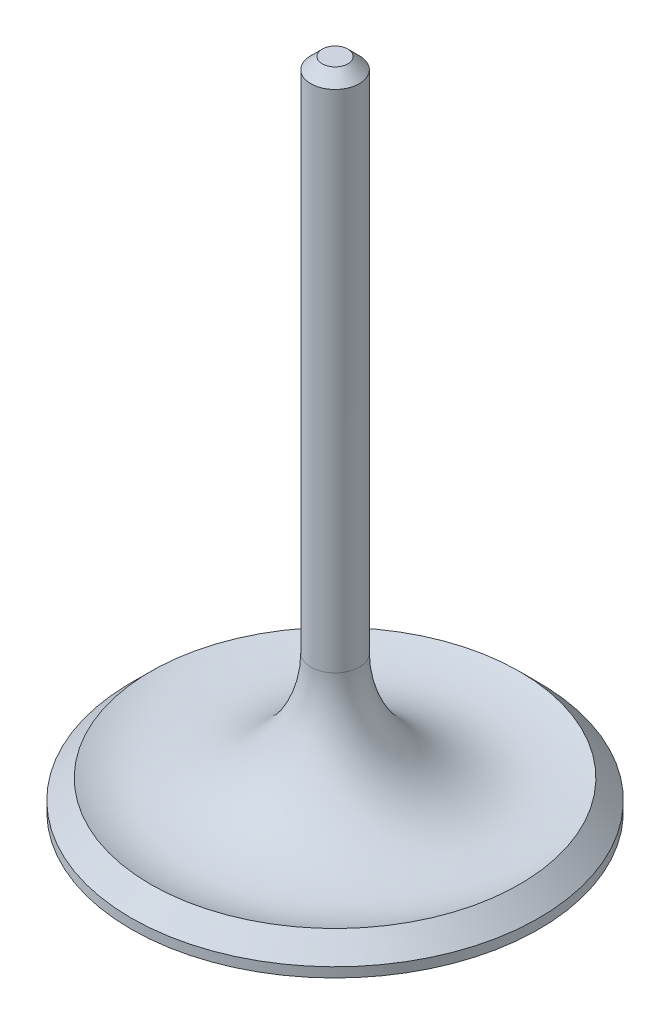
ISO-10303-21;
HEADER;
FILE_DESCRIPTION(('STEP AP214'),'2;1');
FILE_NAME('part.step','',(''),(''),'','','');
FILE_SCHEMA(('AUTOMOTIVE_DESIGN { 1 0 10303 214 1 1 1 1 }'));
ENDSEC;
DATA;
#1=APPLICATION_CONTEXT('core data for automotive mechanical design processes');
#2=APPLICATION_PROTOCOL_DEFINITION('international standard','automotive_design',2000,#1);
#3=PRODUCT_CONTEXT('',#1,'mechanical');
#4=PRODUCT('Part','Part','',(#3));
#5=PRODUCT_RELATED_PRODUCT_CATEGORY('part','',(#4));
#6=PRODUCT_DEFINITION_FORMATION('','',#4);
#7=PRODUCT_DEFINITION_CONTEXT('part definition',#1,'design');
#8=PRODUCT_DEFINITION('design','',#6,#7);
#9=PRODUCT_DEFINITION_SHAPE('','',#8);
#10=(LENGTH_UNIT() NAMED_UNIT(*) SI_UNIT(.MILLI.,.METRE.));
#11=(NAMED_UNIT(*) PLANE_ANGLE_UNIT() SI_UNIT($,.RADIAN.));
#12=(NAMED_UNIT(*) SI_UNIT($,.STERADIAN.) SOLID_ANGLE_UNIT());
#13=UNCERTAINTY_MEASURE_WITH_UNIT(LENGTH_MEASURE(1.E-05),#10,'distance_accuracy_value','');
#14=(GEOMETRIC_REPRESENTATION_CONTEXT(3) GLOBAL_UNCERTAINTY_ASSIGNED_CONTEXT((#13)) GLOBAL_UNIT_ASSIGNED_CONTEXT((#10,
#11,#12)) REPRESENTATION_CONTEXT('',''));
#15=CARTESIAN_POINT('',(0.,0.,0.));
#16=DIRECTION('',(0.,0.,1.));
#17=DIRECTION('',(1.,0.,0.));
#18=AXIS2_PLACEMENT_3D('',#15,#16,#17);
#19=CARTESIAN_POINT('',(3.175,85.55,0.));
#20=DIRECTION('',(0.,-1.,0.));
#21=DIRECTION('',(0.,0.,-1.));
#22=AXIS2_PLACEMENT_3D('',#19,#20,#21);
#23=PLANE('',#22);
#24=CARTESIAN_POINT('',(0.,85.55,0.));
#25=DIRECTION('',(0.,-1.,0.));
#26=DIRECTION('',(0.,0.,-1.));
#27=AXIS2_PLACEMENT_3D('',#24,#25,#26);
#28=CIRCLE('',#27,1.67500000000001);
#29=CARTESIAN_POINT('',(0.,85.55,-1.67500000000001));
#30=VERTEX_POINT('',#29);
#31=EDGE_CURVE('E37',#30,#30,#28,.F.);
#32=ORIENTED_EDGE('',*,*,#31,.T.);
#33=EDGE_LOOP('',(#32));
#34=FACE_BOUND('',#33,.T.);
#35=ADVANCED_FACE('F30',(#34),#23,.F.);
#36=CARTESIAN_POINT('',(0.,85.55,0.));
#37=DIRECTION('',(0.,1.,0.));
#38=DIRECTION('',(0.,0.,1.));
#39=AXIS2_PLACEMENT_3D('',#36,#37,#38);
#40=CYLINDRICAL_SURFACE('',#39,3.175);
#41=CARTESIAN_POINT('',(0.,84.05,0.));
#42=DIRECTION('',(0.,-1.,0.));
#43=DIRECTION('',(0.,0.,-1.));
#44=AXIS2_PLACEMENT_3D('',#41,#42,#43);
#45=CIRCLE('',#44,3.175);
#46=CARTESIAN_POINT('',(0.,84.05,-3.175));
#47=VERTEX_POINT('',#46);
#48=EDGE_CURVE('E10',#47,#47,#45,.T.);
#49=ORIENTED_EDGE('',*,*,#48,.T.);
#50=EDGE_LOOP('',(#49));
#51=FACE_BOUND('',#50,.T.);
#52=CARTESIAN_POINT('',(0.,17.9526827370199,0.));
#53=DIRECTION('',(0.,1.,0.));
#54=DIRECTION('',(0.,0.,1.));
#55=AXIS2_PLACEMENT_3D('',#52,#53,#54);
#56=CIRCLE('',#55,3.175);
#57=CARTESIAN_POINT('',(0.,17.9526827370199,3.175));
#58=VERTEX_POINT('',#57);
#59=EDGE_CURVE('E41',#58,#58,#56,.T.);
#60=ORIENTED_EDGE('',*,*,#59,.T.);
#61=EDGE_LOOP('',(#60));
#62=FACE_BOUND('',#61,.T.);
#63=ADVANCED_FACE('F71',(#51,#62),#40,.T.);
#64=CARTESIAN_POINT('',(0.,17.9526827370199,0.));
#65=DIRECTION('',(0.,1.,0.));
#66=DIRECTION('',(0.,0.,1.));
#67=AXIS2_PLACEMENT_3D('',#64,#65,#66);
#68=TOROIDAL_SURFACE('',#67,18.425,15.25);
#69=ORIENTED_EDGE('',*,*,#59,.F.);
#70=EDGE_LOOP('',(#69));
#71=FACE_BOUND('',#70,.T.);
#72=CARTESIAN_POINT('',(0.,3.80999999999999,0.));
#73=DIRECTION('',(0.,1.,0.));
#74=DIRECTION('',(0.,0.,1.));
#75=AXIS2_PLACEMENT_3D('',#72,#73,#74);
#76=CIRCLE('',#75,24.13);
#77=CARTESIAN_POINT('',(0.,3.80999999999999,24.13));
#78=VERTEX_POINT('',#77);
#79=EDGE_CURVE('E45',#78,#78,#76,.T.);
#80=ORIENTED_EDGE('',*,*,#79,.T.);
#81=EDGE_LOOP('',(#80));
#82=FACE_BOUND('',#81,.T.);
#83=ADVANCED_FACE('F75',(#71,#82),#68,.F.);
#84=CARTESIAN_POINT('',(0.,1.27000000000001,0.));
#85=DIRECTION('',(0.,-1.,0.));
#86=DIRECTION('',(0.,0.,-1.));
#87=AXIS2_PLACEMENT_3D('',#84,#85,#86);
#88=CONICAL_SURFACE('',#87,26.67,0.785398163397457);
#89=ORIENTED_EDGE('',*,*,#79,.F.);
#90=EDGE_LOOP('',(#89));
#91=FACE_BOUND('',#90,.T.);
#92=CARTESIAN_POINT('',(0.,1.27000000000001,0.));
#93=DIRECTION('',(0.,1.,0.));
#94=DIRECTION('',(0.,0.,1.));
#95=AXIS2_PLACEMENT_3D('',#92,#93,#94);
#96=CIRCLE('',#95,26.67);
#97=CARTESIAN_POINT('',(0.,1.27000000000001,26.67));
#98=VERTEX_POINT('',#97);
#99=EDGE_CURVE('E50',#98,#98,#96,.T.);
#100=ORIENTED_EDGE('',*,*,#99,.T.);
#101=EDGE_LOOP('',(#100));
#102=FACE_BOUND('',#101,.T.);
#103=ADVANCED_FACE('F67',(#91,#102),#88,.T.);
#104=CARTESIAN_POINT('',(0.,85.55,0.));
#105=DIRECTION('',(0.,1.,0.));
#106=DIRECTION('',(0.,0.,1.));
#107=AXIS2_PLACEMENT_3D('',#104,#105,#106);
#108=CYLINDRICAL_SURFACE('',#107,26.67);
#109=ORIENTED_EDGE('',*,*,#99,.F.);
#110=EDGE_LOOP('',(#109));
#111=FACE_BOUND('',#110,.T.);
#112=CARTESIAN_POINT('',(0.,0.,0.));
#113=DIRECTION('',(0.,1.,0.));
#114=DIRECTION('',(0.,0.,1.));
#115=AXIS2_PLACEMENT_3D('',#112,#113,#114);
#116=CIRCLE('',#115,26.67);
#117=CARTESIAN_POINT('',(0.,0.,26.67));
#118=VERTEX_POINT('',#117);
#119=EDGE_CURVE('E53',#118,#118,#116,.T.);
#120=ORIENTED_EDGE('',*,*,#119,.T.);
#121=EDGE_LOOP('',(#120));
#122=FACE_BOUND('',#121,.T.);
#123=ADVANCED_FACE('F57',(#111,#122),#108,.T.);
#124=CARTESIAN_POINT('',(0.,0.,0.));
#125=DIRECTION('',(0.,1.,0.));
#126=DIRECTION('',(0.,0.,1.));
#127=AXIS2_PLACEMENT_3D('',#124,#125,#126);
#128=PLANE('',#127);
#129=ORIENTED_EDGE('',*,*,#119,.F.);
#130=EDGE_LOOP('',(#129));
#131=FACE_BOUND('',#130,.T.);
#132=ADVANCED_FACE('F59',(#131),#128,.F.);
#133=CARTESIAN_POINT('',(0.,85.55,0.));
#134=DIRECTION('',(0.,-1.,0.));
#135=DIRECTION('',(0.,0.,-1.));
#136=AXIS2_PLACEMENT_3D('',#133,#134,#135);
#137=CONICAL_SURFACE('',#136,1.67500000000001,0.785398163397449);
#138=ORIENTED_EDGE('',*,*,#48,.F.);
#139=EDGE_LOOP('',(#138));
#140=FACE_BOUND('',#139,.T.);
#141=ORIENTED_EDGE('',*,*,#31,.F.);
#142=EDGE_LOOP('',(#141));
#143=FACE_BOUND('',#142,.T.);
#144=ADVANCED_FACE('F32',(#140,#143),#137,.T.);
#145=CLOSED_SHELL('',(#35,#63,#83,#103,#123,#132,#144));
#146=MANIFOLD_SOLID_BREP('B2',#145);
#147=ADVANCED_BREP_SHAPE_REPRESENTATION('',(#18,#146),#14);
#148=SHAPE_DEFINITION_REPRESENTATION(#9,#147);
ENDSEC;
END-ISO-10303-21;
